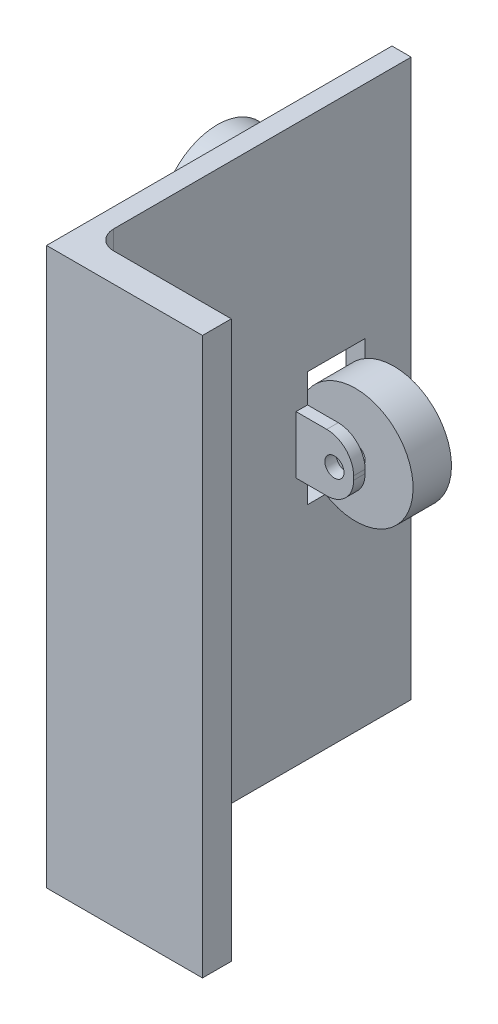
ISO-10303-21;
HEADER;
FILE_DESCRIPTION(('STEP AP214'),'2;1');
FILE_NAME('part.step','',(''),(''),'','','');
FILE_SCHEMA(('AUTOMOTIVE_DESIGN { 1 0 10303 214 1 1 1 1 }'));
ENDSEC;
DATA;
#1=APPLICATION_CONTEXT('core data for automotive mechanical design processes');
#2=APPLICATION_PROTOCOL_DEFINITION('international standard','automotive_design',2000,#1);
#3=PRODUCT_CONTEXT('',#1,'mechanical');
#4=PRODUCT('Part','Part','',(#3));
#5=PRODUCT_RELATED_PRODUCT_CATEGORY('part','',(#4));
#6=PRODUCT_DEFINITION_FORMATION('','',#4);
#7=PRODUCT_DEFINITION_CONTEXT('part definition',#1,'design');
#8=PRODUCT_DEFINITION('design','',#6,#7);
#9=PRODUCT_DEFINITION_SHAPE('','',#8);
#10=(LENGTH_UNIT() NAMED_UNIT(*) SI_UNIT(.MILLI.,.METRE.));
#11=(NAMED_UNIT(*) PLANE_ANGLE_UNIT() SI_UNIT($,.RADIAN.));
#12=(NAMED_UNIT(*) SI_UNIT($,.STERADIAN.) SOLID_ANGLE_UNIT());
#13=UNCERTAINTY_MEASURE_WITH_UNIT(LENGTH_MEASURE(1.E-05),#10,'distance_accuracy_value','');
#14=(GEOMETRIC_REPRESENTATION_CONTEXT(3) GLOBAL_UNCERTAINTY_ASSIGNED_CONTEXT((#13)) GLOBAL_UNIT_ASSIGNED_CONTEXT((#10,
#11,#12)) REPRESENTATION_CONTEXT('',''));
#15=CARTESIAN_POINT('',(0.,0.,0.));
#16=DIRECTION('',(0.,0.,1.));
#17=DIRECTION('',(1.,0.,0.));
#18=AXIS2_PLACEMENT_3D('',#15,#16,#17);
#19=CARTESIAN_POINT('',(15.,72.5,-75.5));
#20=DIRECTION('',(0.,0.,1.));
#21=DIRECTION('',(0.,-1.,0.));
#22=AXIS2_PLACEMENT_3D('',#19,#20,#21);
#23=CYLINDRICAL_SURFACE('',#22,15.);
#24=CARTESIAN_POINT('',(15.,72.5,-75.5));
#25=DIRECTION('',(0.,0.,-1.));
#26=DIRECTION('',(0.,1.,0.));
#27=AXIS2_PLACEMENT_3D('',#24,#25,#26);
#28=CIRCLE('',#27,15.);
#29=CARTESIAN_POINT('',(15.,87.5,-75.5));
#30=VERTEX_POINT('',#29);
#31=EDGE_CURVE('E11',#30,#30,#28,.T.);
#32=ORIENTED_EDGE('',*,*,#31,.F.);
#33=EDGE_LOOP('',(#32));
#34=FACE_BOUND('',#33,.T.);
#35=CARTESIAN_POINT('',(15.,72.5,-65.5));
#36=DIRECTION('',(0.,0.,-1.));
#37=DIRECTION('',(0.,1.,0.));
#38=AXIS2_PLACEMENT_3D('',#35,#36,#37);
#39=CIRCLE('',#38,15.);
#40=CARTESIAN_POINT('',(15.,87.5,-65.5));
#41=VERTEX_POINT('',#40);
#42=EDGE_CURVE('E48',#41,#41,#39,.T.);
#43=ORIENTED_EDGE('',*,*,#42,.T.);
#44=EDGE_LOOP('',(#43));
#45=FACE_BOUND('',#44,.T.);
#46=ADVANCED_FACE('F41',(#34,#45),#23,.T.);
#47=CARTESIAN_POINT('',(15.,72.5,-75.5));
#48=DIRECTION('',(0.,0.,-1.));
#49=DIRECTION('',(0.,1.,0.));
#50=AXIS2_PLACEMENT_3D('',#47,#48,#49);
#51=PLANE('',#50);
#52=CARTESIAN_POINT('',(15.,72.5,-75.5));
#53=DIRECTION('',(0.,0.,-1.));
#54=DIRECTION('',(0.,1.,0.));
#55=AXIS2_PLACEMENT_3D('',#52,#53,#54);
#56=CIRCLE('',#55,2.5);
#57=CARTESIAN_POINT('',(15.,75.,-75.5));
#58=VERTEX_POINT('',#57);
#59=EDGE_CURVE('E53',#58,#58,#56,.T.);
#60=ORIENTED_EDGE('',*,*,#59,.F.);
#61=EDGE_LOOP('',(#60));
#62=FACE_BOUND('',#61,.T.);
#63=ORIENTED_EDGE('',*,*,#31,.T.);
#64=EDGE_LOOP('',(#63));
#65=FACE_BOUND('',#64,.T.);
#66=ADVANCED_FACE('F70',(#62,#65),#51,.T.);
#67=CARTESIAN_POINT('',(15.,72.5,-65.5));
#68=DIRECTION('',(0.,0.,-1.));
#69=DIRECTION('',(0.,1.,0.));
#70=AXIS2_PLACEMENT_3D('',#67,#68,#69);
#71=PLANE('',#70);
#72=CARTESIAN_POINT('',(15.,72.5,-65.5));
#73=DIRECTION('',(0.,0.,-1.));
#74=DIRECTION('',(0.,1.,0.));
#75=AXIS2_PLACEMENT_3D('',#72,#73,#74);
#76=CIRCLE('',#75,2.5);
#77=CARTESIAN_POINT('',(15.,75.,-65.5));
#78=VERTEX_POINT('',#77);
#79=EDGE_CURVE('E44',#78,#78,#76,.T.);
#80=ORIENTED_EDGE('',*,*,#79,.T.);
#81=EDGE_LOOP('',(#80));
#82=FACE_BOUND('',#81,.T.);
#83=ORIENTED_EDGE('',*,*,#42,.F.);
#84=EDGE_LOOP('',(#83));
#85=FACE_BOUND('',#84,.T.);
#86=ADVANCED_FACE('F61',(#82,#85),#71,.F.);
#87=CARTESIAN_POINT('',(15.,72.5,-56.));
#88=DIRECTION('',(0.,0.,-1.));
#89=DIRECTION('',(-1.,0.,0.));
#90=AXIS2_PLACEMENT_3D('',#87,#88,#89);
#91=CYLINDRICAL_SURFACE('',#90,2.5);
#92=ORIENTED_EDGE('',*,*,#59,.T.);
#93=EDGE_LOOP('',(#92));
#94=FACE_BOUND('',#93,.T.);
#95=ORIENTED_EDGE('',*,*,#79,.F.);
#96=EDGE_LOOP('',(#95));
#97=FACE_BOUND('',#96,.T.);
#98=ADVANCED_FACE('F64',(#94,#97),#91,.F.);
#99=CLOSED_SHELL('',(#46,#66,#86,#98));
#100=MANIFOLD_SOLID_BREP('B2',#99);
#101=CARTESIAN_POINT('',(5.,145.,-90.));
#102=DIRECTION('',(-1.,0.,0.));
#103=DIRECTION('',(0.,0.,1.));
#104=AXIS2_PLACEMENT_3D('',#101,#102,#103);
#105=PLANE('',#104);
#106=DIRECTION('',(0.,0.,-1.));
#107=VECTOR('',#106,1.);
#108=CARTESIAN_POINT('',(5.,0.,-90.));
#109=LINE('',#108,#107);
#110=CARTESIAN_POINT('',(5.,0.,-12.5));
#111=VERTEX_POINT('',#110);
#112=CARTESIAN_POINT('',(5.,0.,-90.));
#113=VERTEX_POINT('',#112);
#114=EDGE_CURVE('E381',#111,#113,#109,.T.);
#115=ORIENTED_EDGE('',*,*,#114,.T.);
#116=DIRECTION('',(0.,-1.,0.));
#117=VECTOR('',#116,1.);
#118=CARTESIAN_POINT('',(5.,145.,-90.));
#119=LINE('',#118,#117);
#120=CARTESIAN_POINT('',(5.,145.,-90.));
#121=VERTEX_POINT('',#120);
#122=EDGE_CURVE('E391',#121,#113,#119,.T.);
#123=ORIENTED_EDGE('',*,*,#122,.F.);
#124=DIRECTION('',(0.,0.,-1.));
#125=VECTOR('',#124,1.);
#126=CARTESIAN_POINT('',(5.,145.,-90.));
#127=LINE('',#126,#125);
#128=CARTESIAN_POINT('',(5.,145.,-12.5));
#129=VERTEX_POINT('',#128);
#130=EDGE_CURVE('E366',#129,#121,#127,.T.);
#131=ORIENTED_EDGE('',*,*,#130,.F.);
#132=DIRECTION('',(0.,-1.,0.));
#133=VECTOR('',#132,1.);
#134=CARTESIAN_POINT('',(5.,145.,-12.5));
#135=LINE('',#134,#133);
#136=EDGE_CURVE('E394',#129,#111,#135,.T.);
#137=ORIENTED_EDGE('',*,*,#136,.T.);
#138=EDGE_LOOP('',(#115,#123,#131,#137));
#139=FACE_BOUND('',#138,.T.);
#140=DIRECTION('',(0.,0.,1.));
#141=VECTOR('',#140,1.);
#142=CARTESIAN_POINT('',(5.,80.,-78.));
#143=LINE('',#142,#141);
#144=CARTESIAN_POINT('',(5.,80.,-81.));
#145=VERTEX_POINT('',#144);
#146=CARTESIAN_POINT('',(5.,80.,-78.));
#147=VERTEX_POINT('',#146);
#148=EDGE_CURVE('E285',#145,#147,#143,.T.);
#149=ORIENTED_EDGE('',*,*,#148,.F.);
#150=DIRECTION('',(0.,1.,0.));
#151=VECTOR('',#150,1.);
#152=CARTESIAN_POINT('',(5.,80.,-81.));
#153=LINE('',#152,#151);
#154=CARTESIAN_POINT('',(5.,65.,-81.));
#155=VERTEX_POINT('',#154);
#156=EDGE_CURVE('E284',#155,#145,#153,.T.);
#157=ORIENTED_EDGE('',*,*,#156,.F.);
#158=DIRECTION('',(0.,0.,-1.));
#159=VECTOR('',#158,1.);
#160=CARTESIAN_POINT('',(5.,65.,-78.));
#161=LINE('',#160,#159);
#162=CARTESIAN_POINT('',(5.,65.,-78.));
#163=VERTEX_POINT('',#162);
#164=EDGE_CURVE('E262',#163,#155,#161,.T.);
#165=ORIENTED_EDGE('',*,*,#164,.F.);
#166=DIRECTION('',(0.,-1.,0.));
#167=VECTOR('',#166,1.);
#168=CARTESIAN_POINT('',(5.,145.,-78.0000000000001));
#169=LINE('',#168,#167);
#170=CARTESIAN_POINT('',(5.,57.5,-78.));
#171=VERTEX_POINT('',#170);
#172=EDGE_CURVE('E270',#163,#171,#169,.T.);
#173=ORIENTED_EDGE('',*,*,#172,.T.);
#174=DIRECTION('',(0.,0.,1.));
#175=VECTOR('',#174,1.);
#176=CARTESIAN_POINT('',(5.,57.5,-90.));
#177=LINE('',#176,#175);
#178=CARTESIAN_POINT('',(5.,57.5,-63.));
#179=VERTEX_POINT('',#178);
#180=EDGE_CURVE('E335',#171,#179,#177,.T.);
#181=ORIENTED_EDGE('',*,*,#180,.T.);
#182=DIRECTION('',(0.,1.,0.));
#183=VECTOR('',#182,1.);
#184=CARTESIAN_POINT('',(5.,145.,-63.));
#185=LINE('',#184,#183);
#186=CARTESIAN_POINT('',(5.,65.,-63.));
#187=VERTEX_POINT('',#186);
#188=EDGE_CURVE('E343',#179,#187,#185,.T.);
#189=ORIENTED_EDGE('',*,*,#188,.T.);
#190=DIRECTION('',(0.,0.,-1.));
#191=VECTOR('',#190,1.);
#192=CARTESIAN_POINT('',(5.,65.,-63.));
#193=LINE('',#192,#191);
#194=CARTESIAN_POINT('',(5.,65.,-60.));
#195=VERTEX_POINT('',#194);
#196=EDGE_CURVE('E304',#195,#187,#193,.T.);
#197=ORIENTED_EDGE('',*,*,#196,.F.);
#198=DIRECTION('',(0.,-1.,0.));
#199=VECTOR('',#198,1.);
#200=CARTESIAN_POINT('',(5.,80.,-60.));
#201=LINE('',#200,#199);
#202=CARTESIAN_POINT('',(5.,80.,-60.));
#203=VERTEX_POINT('',#202);
#204=EDGE_CURVE('E310',#203,#195,#201,.T.);
#205=ORIENTED_EDGE('',*,*,#204,.F.);
#206=DIRECTION('',(0.,0.,1.));
#207=VECTOR('',#206,1.);
#208=CARTESIAN_POINT('',(5.,80.,-63.));
#209=LINE('',#208,#207);
#210=CARTESIAN_POINT('',(5.,80.,-63.));
#211=VERTEX_POINT('',#210);
#212=EDGE_CURVE('E299',#211,#203,#209,.T.);
#213=ORIENTED_EDGE('',*,*,#212,.F.);
#214=CARTESIAN_POINT('',(5.,87.5,-63.));
#215=VERTEX_POINT('',#214);
#216=EDGE_CURVE('E342',#211,#215,#185,.T.);
#217=ORIENTED_EDGE('',*,*,#216,.T.);
#218=DIRECTION('',(0.,0.,-1.));
#219=VECTOR('',#218,1.);
#220=CARTESIAN_POINT('',(5.,87.5,-90.));
#221=LINE('',#220,#219);
#222=CARTESIAN_POINT('',(5.,87.5,-78.));
#223=VERTEX_POINT('',#222);
#224=EDGE_CURVE('E279',#215,#223,#221,.T.);
#225=ORIENTED_EDGE('',*,*,#224,.T.);
#226=EDGE_CURVE('E278',#223,#147,#169,.T.);
#227=ORIENTED_EDGE('',*,*,#226,.T.);
#228=EDGE_LOOP('',(#149,#157,#165,#173,#181,#189,#197,#205,#213,#217,#225,#227));
#229=FACE_BOUND('',#228,.T.);
#230=ADVANCED_FACE('F103',(#139,#229),#105,.F.);
#231=CARTESIAN_POINT('',(0.,145.,0.));
#232=DIRECTION('',(0.,0.,-1.));
#233=DIRECTION('',(-1.,0.,0.));
#234=AXIS2_PLACEMENT_3D('',#231,#232,#233);
#235=PLANE('',#234);
#236=DIRECTION('',(1.,0.,0.));
#237=VECTOR('',#236,1.);
#238=CARTESIAN_POINT('',(0.,0.,0.));
#239=LINE('',#238,#237);
#240=CARTESIAN_POINT('',(0.,0.,0.));
#241=VERTEX_POINT('',#240);
#242=CARTESIAN_POINT('',(40.625,0.,0.));
#243=VERTEX_POINT('',#242);
#244=EDGE_CURVE('E355',#241,#243,#239,.T.);
#245=ORIENTED_EDGE('',*,*,#244,.T.);
#246=DIRECTION('',(0.,-1.,0.));
#247=VECTOR('',#246,1.);
#248=CARTESIAN_POINT('',(40.625,145.,0.));
#249=LINE('',#248,#247);
#250=CARTESIAN_POINT('',(40.625,145.,0.));
#251=VERTEX_POINT('',#250);
#252=EDGE_CURVE('E403',#251,#243,#249,.T.);
#253=ORIENTED_EDGE('',*,*,#252,.F.);
#254=DIRECTION('',(1.,0.,0.));
#255=VECTOR('',#254,1.);
#256=CARTESIAN_POINT('',(0.,145.,0.));
#257=LINE('',#256,#255);
#258=CARTESIAN_POINT('',(0.,145.,0.));
#259=VERTEX_POINT('',#258);
#260=EDGE_CURVE('E356',#259,#251,#257,.T.);
#261=ORIENTED_EDGE('',*,*,#260,.F.);
#262=DIRECTION('',(0.,-1.,0.));
#263=VECTOR('',#262,1.);
#264=CARTESIAN_POINT('',(0.,145.,0.));
#265=LINE('',#264,#263);
#266=EDGE_CURVE('E372',#259,#241,#265,.T.);
#267=ORIENTED_EDGE('',*,*,#266,.T.);
#268=EDGE_LOOP('',(#245,#253,#261,#267));
#269=FACE_BOUND('',#268,.T.);
#270=ADVANCED_FACE('F480',(#269),#235,.F.);
#271=CARTESIAN_POINT('',(40.625,145.,0.));
#272=DIRECTION('',(-1.,0.,0.));
#273=DIRECTION('',(0.,0.,1.));
#274=AXIS2_PLACEMENT_3D('',#271,#272,#273);
#275=PLANE('',#274);
#276=DIRECTION('',(0.,0.,-1.));
#277=VECTOR('',#276,1.);
#278=CARTESIAN_POINT('',(40.625,0.,0.));
#279=LINE('',#278,#277);
#280=CARTESIAN_POINT('',(40.625,0.,-7.5));
#281=VERTEX_POINT('',#280);
#282=EDGE_CURVE('E375',#243,#281,#279,.T.);
#283=ORIENTED_EDGE('',*,*,#282,.T.);
#284=DIRECTION('',(0.,-1.,0.));
#285=VECTOR('',#284,1.);
#286=CARTESIAN_POINT('',(40.625,145.,-7.5));
#287=LINE('',#286,#285);
#288=CARTESIAN_POINT('',(40.625,145.,-7.5));
#289=VERTEX_POINT('',#288);
#290=EDGE_CURVE('E400',#289,#281,#287,.T.);
#291=ORIENTED_EDGE('',*,*,#290,.F.);
#292=DIRECTION('',(0.,0.,-1.));
#293=VECTOR('',#292,1.);
#294=CARTESIAN_POINT('',(40.625,145.,0.));
#295=LINE('',#294,#293);
#296=EDGE_CURVE('E359',#251,#289,#295,.T.);
#297=ORIENTED_EDGE('',*,*,#296,.F.);
#298=ORIENTED_EDGE('',*,*,#252,.T.);
#299=EDGE_LOOP('',(#283,#291,#297,#298));
#300=FACE_BOUND('',#299,.T.);
#301=ADVANCED_FACE('F488',(#300),#275,.F.);
#302=CARTESIAN_POINT('',(10.,145.,-7.5));
#303=DIRECTION('',(0.,0.,1.));
#304=DIRECTION('',(1.,0.,0.));
#305=AXIS2_PLACEMENT_3D('',#302,#303,#304);
#306=PLANE('',#305);
#307=DIRECTION('',(-1.,0.,0.));
#308=VECTOR('',#307,1.);
#309=CARTESIAN_POINT('',(10.,0.,-7.5));
#310=LINE('',#309,#308);
#311=CARTESIAN_POINT('',(10.,0.,-7.5));
#312=VERTEX_POINT('',#311);
#313=EDGE_CURVE('E377',#281,#312,#310,.T.);
#314=ORIENTED_EDGE('',*,*,#313,.T.);
#315=DIRECTION('',(0.,-1.,0.));
#316=VECTOR('',#315,1.);
#317=CARTESIAN_POINT('',(10.,145.,-7.5));
#318=LINE('',#317,#316);
#319=CARTESIAN_POINT('',(10.,145.,-7.5));
#320=VERTEX_POINT('',#319);
#321=EDGE_CURVE('E397',#320,#312,#318,.T.);
#322=ORIENTED_EDGE('',*,*,#321,.F.);
#323=DIRECTION('',(-1.,0.,0.));
#324=VECTOR('',#323,1.);
#325=CARTESIAN_POINT('',(10.,145.,-7.5));
#326=LINE('',#325,#324);
#327=EDGE_CURVE('E362',#289,#320,#326,.T.);
#328=ORIENTED_EDGE('',*,*,#327,.F.);
#329=ORIENTED_EDGE('',*,*,#290,.T.);
#330=EDGE_LOOP('',(#314,#322,#328,#329));
#331=FACE_BOUND('',#330,.T.);
#332=ADVANCED_FACE('F498',(#331),#306,.F.);
#333=CARTESIAN_POINT('',(10.,145.,-12.5));
#334=DIRECTION('',(0.,-1.,0.));
#335=DIRECTION('',(0.,0.,-1.));
#336=AXIS2_PLACEMENT_3D('',#333,#334,#335);
#337=CYLINDRICAL_SURFACE('',#336,5.);
#338=CARTESIAN_POINT('',(10.,0.,-12.5));
#339=DIRECTION('',(0.,-1.,0.));
#340=DIRECTION('',(0.,0.,1.));
#341=AXIS2_PLACEMENT_3D('',#338,#339,#340);
#342=CIRCLE('',#341,5.);
#343=EDGE_CURVE('E379',#312,#111,#342,.T.);
#344=ORIENTED_EDGE('',*,*,#343,.T.);
#345=ORIENTED_EDGE('',*,*,#136,.F.);
#346=CARTESIAN_POINT('',(10.,145.,-12.5));
#347=DIRECTION('',(0.,-1.,0.));
#348=DIRECTION('',(0.,0.,1.));
#349=AXIS2_PLACEMENT_3D('',#346,#347,#348);
#350=CIRCLE('',#349,5.);
#351=EDGE_CURVE('E364',#320,#129,#350,.T.);
#352=ORIENTED_EDGE('',*,*,#351,.F.);
#353=ORIENTED_EDGE('',*,*,#321,.T.);
#354=EDGE_LOOP('',(#344,#345,#352,#353));
#355=FACE_BOUND('',#354,.T.);
#356=ADVANCED_FACE('F495',(#355),#337,.F.);
#357=CARTESIAN_POINT('',(0.,145.,-90.));
#358=DIRECTION('',(0.,0.,1.));
#359=DIRECTION('',(1.,0.,0.));
#360=AXIS2_PLACEMENT_3D('',#357,#358,#359);
#361=PLANE('',#360);
#362=DIRECTION('',(-1.,0.,0.));
#363=VECTOR('',#362,1.);
#364=CARTESIAN_POINT('',(0.,0.,-90.));
#365=LINE('',#364,#363);
#366=CARTESIAN_POINT('',(0.,0.,-90.));
#367=VERTEX_POINT('',#366);
#368=EDGE_CURVE('E383',#113,#367,#365,.T.);
#369=ORIENTED_EDGE('',*,*,#368,.T.);
#370=DIRECTION('',(0.,-1.,0.));
#371=VECTOR('',#370,1.);
#372=CARTESIAN_POINT('',(0.,145.,-90.));
#373=LINE('',#372,#371);
#374=CARTESIAN_POINT('',(0.,145.,-90.));
#375=VERTEX_POINT('',#374);
#376=EDGE_CURVE('E388',#375,#367,#373,.T.);
#377=ORIENTED_EDGE('',*,*,#376,.F.);
#378=DIRECTION('',(-1.,0.,0.));
#379=VECTOR('',#378,1.);
#380=CARTESIAN_POINT('',(0.,145.,-90.));
#381=LINE('',#380,#379);
#382=EDGE_CURVE('E368',#121,#375,#381,.T.);
#383=ORIENTED_EDGE('',*,*,#382,.F.);
#384=ORIENTED_EDGE('',*,*,#122,.T.);
#385=EDGE_LOOP('',(#369,#377,#383,#384));
#386=FACE_BOUND('',#385,.T.);
#387=ADVANCED_FACE('F493',(#386),#361,.F.);
#388=CARTESIAN_POINT('',(0.,145.,0.));
#389=DIRECTION('',(1.,0.,0.));
#390=DIRECTION('',(0.,0.,-1.));
#391=AXIS2_PLACEMENT_3D('',#388,#389,#390);
#392=PLANE('',#391);
#393=DIRECTION('',(0.,0.,1.));
#394=VECTOR('',#393,1.);
#395=CARTESIAN_POINT('',(0.,57.5,-78.));
#396=LINE('',#395,#394);
#397=CARTESIAN_POINT('',(0.,57.5,-78.));
#398=VERTEX_POINT('',#397);
#399=CARTESIAN_POINT('',(0.,57.5,-63.));
#400=VERTEX_POINT('',#399);
#401=EDGE_CURVE('E324',#398,#400,#396,.T.);
#402=ORIENTED_EDGE('',*,*,#401,.F.);
#403=DIRECTION('',(0.,-1.,0.));
#404=VECTOR('',#403,1.);
#405=CARTESIAN_POINT('',(0.,87.5,-78.));
#406=LINE('',#405,#404);
#407=CARTESIAN_POINT('',(0.,87.5,-78.));
#408=VERTEX_POINT('',#407);
#409=EDGE_CURVE('E322',#408,#398,#406,.T.);
#410=ORIENTED_EDGE('',*,*,#409,.F.);
#411=DIRECTION('',(0.,0.,-1.));
#412=VECTOR('',#411,1.);
#413=CARTESIAN_POINT('',(0.,87.5,-78.));
#414=LINE('',#413,#412);
#415=CARTESIAN_POINT('',(0.,87.5,-63.));
#416=VERTEX_POINT('',#415);
#417=EDGE_CURVE('E330',#416,#408,#414,.T.);
#418=ORIENTED_EDGE('',*,*,#417,.F.);
#419=DIRECTION('',(0.,1.,0.));
#420=VECTOR('',#419,1.);
#421=CARTESIAN_POINT('',(0.,87.5,-63.));
#422=LINE('',#421,#420);
#423=EDGE_CURVE('E327',#400,#416,#422,.T.);
#424=ORIENTED_EDGE('',*,*,#423,.F.);
#425=EDGE_LOOP('',(#402,#410,#418,#424));
#426=FACE_BOUND('',#425,.T.);
#427=CARTESIAN_POINT('',(0.,20.,-54.5));
#428=DIRECTION('',(1.,0.,0.));
#429=DIRECTION('',(0.,0.,-1.));
#430=AXIS2_PLACEMENT_3D('',#427,#428,#429);
#431=CIRCLE('',#430,15.);
#432=CARTESIAN_POINT('',(0.,20.,-69.5));
#433=VERTEX_POINT('',#432);
#434=EDGE_CURVE('E409',#433,#433,#431,.F.);
#435=ORIENTED_EDGE('',*,*,#434,.F.);
#436=EDGE_LOOP('',(#435));
#437=FACE_BOUND('',#436,.T.);
#438=CARTESIAN_POINT('',(0.,125.,-54.5));
#439=DIRECTION('',(1.,0.,0.));
#440=DIRECTION('',(0.,0.,-1.));
#441=AXIS2_PLACEMENT_3D('',#438,#439,#440);
#442=CIRCLE('',#441,15.);
#443=CARTESIAN_POINT('',(0.,125.,-69.5));
#444=VERTEX_POINT('',#443);
#445=EDGE_CURVE('E406',#444,#444,#442,.F.);
#446=ORIENTED_EDGE('',*,*,#445,.F.);
#447=EDGE_LOOP('',(#446));
#448=FACE_BOUND('',#447,.T.);
#449=DIRECTION('',(0.,0.,1.));
#450=VECTOR('',#449,1.);
#451=CARTESIAN_POINT('',(0.,0.,0.));
#452=LINE('',#451,#450);
#453=EDGE_CURVE('E360',#367,#241,#452,.T.);
#454=ORIENTED_EDGE('',*,*,#453,.T.);
#455=ORIENTED_EDGE('',*,*,#266,.F.);
#456=DIRECTION('',(0.,0.,1.));
#457=VECTOR('',#456,1.);
#458=CARTESIAN_POINT('',(0.,145.,0.));
#459=LINE('',#458,#457);
#460=EDGE_CURVE('E370',#375,#259,#459,.T.);
#461=ORIENTED_EDGE('',*,*,#460,.F.);
#462=ORIENTED_EDGE('',*,*,#376,.T.);
#463=EDGE_LOOP('',(#454,#455,#461,#462));
#464=FACE_BOUND('',#463,.T.);
#465=ADVANCED_FACE('F571',(#426,#437,#448,#464),#392,.F.);
#466=CARTESIAN_POINT('',(10.,145.,-12.5));
#467=DIRECTION('',(0.,1.,0.));
#468=DIRECTION('',(0.,0.,1.));
#469=AXIS2_PLACEMENT_3D('',#466,#467,#468);
#470=PLANE('',#469);
#471=ORIENTED_EDGE('',*,*,#260,.T.);
#472=ORIENTED_EDGE('',*,*,#296,.T.);
#473=ORIENTED_EDGE('',*,*,#327,.T.);
#474=ORIENTED_EDGE('',*,*,#351,.T.);
#475=ORIENTED_EDGE('',*,*,#130,.T.);
#476=ORIENTED_EDGE('',*,*,#382,.T.);
#477=ORIENTED_EDGE('',*,*,#460,.T.);
#478=EDGE_LOOP('',(#471,#472,#473,#474,#475,#476,#477));
#479=FACE_BOUND('',#478,.T.);
#480=ADVANCED_FACE('F601',(#479),#470,.T.);
#481=CARTESIAN_POINT('',(10.,0.,-12.5));
#482=DIRECTION('',(0.,1.,0.));
#483=DIRECTION('',(0.,0.,1.));
#484=AXIS2_PLACEMENT_3D('',#481,#482,#483);
#485=PLANE('',#484);
#486=ORIENTED_EDGE('',*,*,#244,.F.);
#487=ORIENTED_EDGE('',*,*,#453,.F.);
#488=ORIENTED_EDGE('',*,*,#368,.F.);
#489=ORIENTED_EDGE('',*,*,#114,.F.);
#490=ORIENTED_EDGE('',*,*,#343,.F.);
#491=ORIENTED_EDGE('',*,*,#313,.F.);
#492=ORIENTED_EDGE('',*,*,#282,.F.);
#493=EDGE_LOOP('',(#486,#487,#488,#489,#490,#491,#492));
#494=FACE_BOUND('',#493,.T.);
#495=ADVANCED_FACE('F599',(#494),#485,.F.);
#496=CARTESIAN_POINT('',(-10.,125.,-54.5));
#497=DIRECTION('',(1.,0.,0.));
#498=DIRECTION('',(0.,0.,-1.));
#499=AXIS2_PLACEMENT_3D('',#496,#497,#498);
#500=CYLINDRICAL_SURFACE('',#499,15.);
#501=CARTESIAN_POINT('',(-10.,125.,-54.5));
#502=DIRECTION('',(-1.,0.,0.));
#503=DIRECTION('',(0.,0.,1.));
#504=AXIS2_PLACEMENT_3D('',#501,#502,#503);
#505=CIRCLE('',#504,15.);
#506=CARTESIAN_POINT('',(-10.,125.,-39.5));
#507=VERTEX_POINT('',#506);
#508=EDGE_CURVE('E352',#507,#507,#505,.T.);
#509=ORIENTED_EDGE('',*,*,#508,.F.);
#510=EDGE_LOOP('',(#509));
#511=FACE_BOUND('',#510,.T.);
#512=ORIENTED_EDGE('',*,*,#445,.T.);
#513=EDGE_LOOP('',(#512));
#514=FACE_BOUND('',#513,.T.);
#515=ADVANCED_FACE('F595',(#511,#514),#500,.T.);
#516=CARTESIAN_POINT('',(-10.,125.,-54.5));
#517=DIRECTION('',(-1.,0.,0.));
#518=DIRECTION('',(0.,0.,1.));
#519=AXIS2_PLACEMENT_3D('',#516,#517,#518);
#520=PLANE('',#519);
#521=ORIENTED_EDGE('',*,*,#508,.T.);
#522=EDGE_LOOP('',(#521));
#523=FACE_BOUND('',#522,.T.);
#524=ADVANCED_FACE('F591',(#523),#520,.T.);
#525=CARTESIAN_POINT('',(-10.,20.,-54.5));
#526=DIRECTION('',(1.,0.,0.));
#527=DIRECTION('',(0.,0.,-1.));
#528=AXIS2_PLACEMENT_3D('',#525,#526,#527);
#529=CYLINDRICAL_SURFACE('',#528,15.);
#530=CARTESIAN_POINT('',(-10.,20.,-54.5));
#531=DIRECTION('',(-1.,0.,0.));
#532=DIRECTION('',(0.,0.,-1.));
#533=AXIS2_PLACEMENT_3D('',#530,#531,#532);
#534=CIRCLE('',#533,15.);
#535=CARTESIAN_POINT('',(-10.,20.,-69.5));
#536=VERTEX_POINT('',#535);
#537=EDGE_CURVE('E349',#536,#536,#534,.T.);
#538=ORIENTED_EDGE('',*,*,#537,.F.);
#539=EDGE_LOOP('',(#538));
#540=FACE_BOUND('',#539,.T.);
#541=ORIENTED_EDGE('',*,*,#434,.T.);
#542=EDGE_LOOP('',(#541));
#543=FACE_BOUND('',#542,.T.);
#544=ADVANCED_FACE('F587',(#540,#543),#529,.T.);
#545=CARTESIAN_POINT('',(-10.,20.,-54.5));
#546=DIRECTION('',(1.,0.,0.));
#547=DIRECTION('',(0.,0.,-1.));
#548=AXIS2_PLACEMENT_3D('',#545,#546,#547);
#549=PLANE('',#548);
#550=ORIENTED_EDGE('',*,*,#537,.T.);
#551=EDGE_LOOP('',(#550));
#552=FACE_BOUND('',#551,.T.);
#553=ADVANCED_FACE('F583',(#552),#549,.F.);
#554=CARTESIAN_POINT('',(10.,87.5,-78.));
#555=DIRECTION('',(0.,0.,-1.));
#556=DIRECTION('',(0.,1.,0.));
#557=AXIS2_PLACEMENT_3D('',#554,#555,#556);
#558=PLANE('',#557);
#559=CARTESIAN_POINT('',(15.,72.5,-78.));
#560=DIRECTION('',(0.,0.,-1.));
#561=DIRECTION('',(0.,1.,0.));
#562=AXIS2_PLACEMENT_3D('',#559,#560,#561);
#563=CIRCLE('',#562,2.5);
#564=CARTESIAN_POINT('',(15.,75.,-78.));
#565=VERTEX_POINT('',#564);
#566=EDGE_CURVE('E290',#565,#565,#563,.T.);
#567=ORIENTED_EDGE('',*,*,#566,.T.);
#568=EDGE_LOOP('',(#567));
#569=FACE_BOUND('',#568,.T.);
#570=DIRECTION('',(0.,-1.,0.));
#571=VECTOR('',#570,1.);
#572=CARTESIAN_POINT('',(20.,80.,-78.));
#573=LINE('',#572,#571);
#574=CARTESIAN_POINT('',(20.,73.,-78.));
#575=VERTEX_POINT('',#574);
#576=CARTESIAN_POINT('',(20.,72.,-78.));
#577=VERTEX_POINT('',#576);
#578=EDGE_CURVE('E287',#575,#577,#573,.T.);
#579=ORIENTED_EDGE('',*,*,#578,.F.);
#580=CARTESIAN_POINT('',(13.,73.,-78.));
#581=DIRECTION('',(0.,0.,-1.));
#582=DIRECTION('',(0.,1.,0.));
#583=AXIS2_PLACEMENT_3D('',#580,#581,#582);
#584=CIRCLE('',#583,7.);
#585=CARTESIAN_POINT('',(13.,80.,-78.));
#586=VERTEX_POINT('',#585);
#587=EDGE_CURVE('E438',#575,#586,#584,.F.);
#588=ORIENTED_EDGE('',*,*,#587,.T.);
#589=DIRECTION('',(-1.,0.,0.));
#590=VECTOR('',#589,1.);
#591=CARTESIAN_POINT('',(20.,80.,-78.));
#592=LINE('',#591,#590);
#593=EDGE_CURVE('E266',#586,#147,#592,.T.);
#594=ORIENTED_EDGE('',*,*,#593,.T.);
#595=ORIENTED_EDGE('',*,*,#226,.F.);
#596=DIRECTION('',(-1.,0.,0.));
#597=VECTOR('',#596,1.);
#598=CARTESIAN_POINT('',(10.,87.5,-78.));
#599=LINE('',#598,#597);
#600=EDGE_CURVE('E333',#223,#408,#599,.T.);
#601=ORIENTED_EDGE('',*,*,#600,.T.);
#602=ORIENTED_EDGE('',*,*,#409,.T.);
#603=DIRECTION('',(-1.,0.,0.));
#604=VECTOR('',#603,1.);
#605=CARTESIAN_POINT('',(10.,57.5,-78.));
#606=LINE('',#605,#604);
#607=EDGE_CURVE('E274',#171,#398,#606,.T.);
#608=ORIENTED_EDGE('',*,*,#607,.F.);
#609=ORIENTED_EDGE('',*,*,#172,.F.);
#610=DIRECTION('',(-1.,0.,0.));
#611=VECTOR('',#610,1.);
#612=CARTESIAN_POINT('',(20.,65.,-78.));
#613=LINE('',#612,#611);
#614=CARTESIAN_POINT('',(13.,65.,-78.));
#615=VERTEX_POINT('',#614);
#616=EDGE_CURVE('E258',#615,#163,#613,.T.);
#617=ORIENTED_EDGE('',*,*,#616,.F.);
#618=CARTESIAN_POINT('',(13.,72.,-78.));
#619=DIRECTION('',(0.,0.,-1.));
#620=DIRECTION('',(0.,1.,0.));
#621=AXIS2_PLACEMENT_3D('',#618,#619,#620);
#622=CIRCLE('',#621,7.);
#623=EDGE_CURVE('E436',#615,#577,#622,.F.);
#624=ORIENTED_EDGE('',*,*,#623,.T.);
#625=EDGE_LOOP('',(#579,#588,#594,#595,#601,#602,#608,#609,#617,#624));
#626=FACE_BOUND('',#625,.T.);
#627=ADVANCED_FACE('F272',(#569,#626),#558,.F.);
#628=CARTESIAN_POINT('',(10.,87.5,-78.));
#629=DIRECTION('',(0.,1.,0.));
#630=DIRECTION('',(0.,0.,1.));
#631=AXIS2_PLACEMENT_3D('',#628,#629,#630);
#632=PLANE('',#631);
#633=DIRECTION('',(-1.,0.,0.));
#634=VECTOR('',#633,1.);
#635=CARTESIAN_POINT('',(10.,87.5,-63.));
#636=LINE('',#635,#634);
#637=EDGE_CURVE('E336',#215,#416,#636,.T.);
#638=ORIENTED_EDGE('',*,*,#637,.T.);
#639=ORIENTED_EDGE('',*,*,#417,.T.);
#640=ORIENTED_EDGE('',*,*,#600,.F.);
#641=ORIENTED_EDGE('',*,*,#224,.F.);
#642=EDGE_LOOP('',(#638,#639,#640,#641));
#643=FACE_BOUND('',#642,.T.);
#644=ADVANCED_FACE('F535',(#643),#632,.F.);
#645=CARTESIAN_POINT('',(10.,87.5,-63.));
#646=DIRECTION('',(0.,0.,1.));
#647=DIRECTION('',(0.,-1.,0.));
#648=AXIS2_PLACEMENT_3D('',#645,#646,#647);
#649=PLANE('',#648);
#650=CARTESIAN_POINT('',(15.,72.5,-63.));
#651=DIRECTION('',(0.,0.,1.));
#652=DIRECTION('',(0.,-1.,0.));
#653=AXIS2_PLACEMENT_3D('',#650,#651,#652);
#654=CIRCLE('',#653,2.5);
#655=CARTESIAN_POINT('',(15.,70.,-63.));
#656=VERTEX_POINT('',#655);
#657=EDGE_CURVE('E457',#656,#656,#654,.T.);
#658=ORIENTED_EDGE('',*,*,#657,.T.);
#659=EDGE_LOOP('',(#658));
#660=FACE_BOUND('',#659,.T.);
#661=DIRECTION('',(-1.,0.,0.));
#662=VECTOR('',#661,1.);
#663=CARTESIAN_POINT('',(20.,80.,-63.));
#664=LINE('',#663,#662);
#665=CARTESIAN_POINT('',(13.,80.,-63.));
#666=VERTEX_POINT('',#665);
#667=EDGE_CURVE('E320',#666,#211,#664,.T.);
#668=ORIENTED_EDGE('',*,*,#667,.F.);
#669=CARTESIAN_POINT('',(13.,73.,-63.));
#670=DIRECTION('',(0.,0.,1.));
#671=DIRECTION('',(0.,-1.,0.));
#672=AXIS2_PLACEMENT_3D('',#669,#670,#671);
#673=CIRCLE('',#672,7.);
#674=CARTESIAN_POINT('',(20.,73.,-63.));
#675=VERTEX_POINT('',#674);
#676=EDGE_CURVE('E426',#666,#675,#673,.F.);
#677=ORIENTED_EDGE('',*,*,#676,.T.);
#678=DIRECTION('',(0.,1.,0.));
#679=VECTOR('',#678,1.);
#680=CARTESIAN_POINT('',(20.,80.,-63.));
#681=LINE('',#680,#679);
#682=CARTESIAN_POINT('',(20.,72.,-63.));
#683=VERTEX_POINT('',#682);
#684=EDGE_CURVE('E300',#683,#675,#681,.T.);
#685=ORIENTED_EDGE('',*,*,#684,.F.);
#686=CARTESIAN_POINT('',(13.,72.,-63.));
#687=DIRECTION('',(0.,0.,1.));
#688=DIRECTION('',(0.,-1.,0.));
#689=AXIS2_PLACEMENT_3D('',#686,#687,#688);
#690=CIRCLE('',#689,7.);
#691=CARTESIAN_POINT('',(13.,65.,-63.));
#692=VERTEX_POINT('',#691);
#693=EDGE_CURVE('E424',#683,#692,#690,.F.);
#694=ORIENTED_EDGE('',*,*,#693,.T.);
#695=DIRECTION('',(-1.,0.,0.));
#696=VECTOR('',#695,1.);
#697=CARTESIAN_POINT('',(20.,65.,-63.));
#698=LINE('',#697,#696);
#699=EDGE_CURVE('E307',#692,#187,#698,.T.);
#700=ORIENTED_EDGE('',*,*,#699,.T.);
#701=ORIENTED_EDGE('',*,*,#188,.F.);
#702=DIRECTION('',(-1.,0.,0.));
#703=VECTOR('',#702,1.);
#704=CARTESIAN_POINT('',(10.,57.5,-63.));
#705=LINE('',#704,#703);
#706=EDGE_CURVE('E338',#179,#400,#705,.T.);
#707=ORIENTED_EDGE('',*,*,#706,.T.);
#708=ORIENTED_EDGE('',*,*,#423,.T.);
#709=ORIENTED_EDGE('',*,*,#637,.F.);
#710=ORIENTED_EDGE('',*,*,#216,.F.);
#711=EDGE_LOOP('',(#668,#677,#685,#694,#700,#701,#707,#708,#709,#710));
#712=FACE_BOUND('',#711,.T.);
#713=ADVANCED_FACE('F531',(#660,#712),#649,.F.);
#714=CARTESIAN_POINT('',(10.,57.5,-78.));
#715=DIRECTION('',(0.,-1.,0.));
#716=DIRECTION('',(0.,0.,-1.));
#717=AXIS2_PLACEMENT_3D('',#714,#715,#716);
#718=PLANE('',#717);
#719=ORIENTED_EDGE('',*,*,#607,.T.);
#720=ORIENTED_EDGE('',*,*,#401,.T.);
#721=ORIENTED_EDGE('',*,*,#706,.F.);
#722=ORIENTED_EDGE('',*,*,#180,.F.);
#723=EDGE_LOOP('',(#719,#720,#721,#722));
#724=FACE_BOUND('',#723,.T.);
#725=ADVANCED_FACE('F534',(#724),#718,.F.);
#726=CARTESIAN_POINT('',(20.,80.,-63.));
#727=DIRECTION('',(0.,-1.,0.));
#728=DIRECTION('',(0.,0.,-1.));
#729=AXIS2_PLACEMENT_3D('',#726,#727,#728);
#730=PLANE('',#729);
#731=DIRECTION('',(-1.,0.,0.));
#732=VECTOR('',#731,1.);
#733=CARTESIAN_POINT('',(20.,80.,-60.));
#734=LINE('',#733,#732);
#735=CARTESIAN_POINT('',(13.,80.,-60.));
#736=VERTEX_POINT('',#735);
#737=EDGE_CURVE('E318',#736,#203,#734,.T.);
#738=ORIENTED_EDGE('',*,*,#737,.F.);
#739=DIRECTION('',(0.,0.,1.));
#740=VECTOR('',#739,1.);
#741=CARTESIAN_POINT('',(13.,80.,-63.));
#742=LINE('',#741,#740);
#743=EDGE_CURVE('E422',#736,#666,#742,.F.);
#744=ORIENTED_EDGE('',*,*,#743,.T.);
#745=ORIENTED_EDGE('',*,*,#667,.T.);
#746=ORIENTED_EDGE('',*,*,#212,.T.);
#747=EDGE_LOOP('',(#738,#744,#745,#746));
#748=FACE_BOUND('',#747,.T.);
#749=ADVANCED_FACE('F562',(#748),#730,.F.);
#750=CARTESIAN_POINT('',(20.,80.,-60.));
#751=DIRECTION('',(0.,0.,-1.));
#752=DIRECTION('',(-1.,0.,0.));
#753=AXIS2_PLACEMENT_3D('',#750,#751,#752);
#754=PLANE('',#753);
#755=CARTESIAN_POINT('',(15.,72.5,-60.));
#756=DIRECTION('',(0.,0.,-1.));
#757=DIRECTION('',(-1.,0.,0.));
#758=AXIS2_PLACEMENT_3D('',#755,#756,#757);
#759=CIRCLE('',#758,2.5);
#760=CARTESIAN_POINT('',(12.5,72.5,-60.));
#761=VERTEX_POINT('',#760);
#762=EDGE_CURVE('E460',#761,#761,#759,.T.);
#763=ORIENTED_EDGE('',*,*,#762,.T.);
#764=EDGE_LOOP('',(#763));
#765=FACE_BOUND('',#764,.T.);
#766=DIRECTION('',(0.,-1.,0.));
#767=VECTOR('',#766,1.);
#768=CARTESIAN_POINT('',(20.,80.,-60.));
#769=LINE('',#768,#767);
#770=CARTESIAN_POINT('',(20.,73.,-60.));
#771=VERTEX_POINT('',#770);
#772=CARTESIAN_POINT('',(20.,72.,-60.));
#773=VERTEX_POINT('',#772);
#774=EDGE_CURVE('E303',#771,#773,#769,.T.);
#775=ORIENTED_EDGE('',*,*,#774,.F.);
#776=CARTESIAN_POINT('',(13.,73.,-60.));
#777=DIRECTION('',(0.,0.,-1.));
#778=DIRECTION('',(-1.,0.,0.));
#779=AXIS2_PLACEMENT_3D('',#776,#777,#778);
#780=CIRCLE('',#779,7.);
#781=EDGE_CURVE('E420',#771,#736,#780,.F.);
#782=ORIENTED_EDGE('',*,*,#781,.T.);
#783=ORIENTED_EDGE('',*,*,#737,.T.);
#784=ORIENTED_EDGE('',*,*,#204,.T.);
#785=DIRECTION('',(-1.,0.,0.));
#786=VECTOR('',#785,1.);
#787=CARTESIAN_POINT('',(20.,65.,-60.));
#788=LINE('',#787,#786);
#789=CARTESIAN_POINT('',(13.,65.,-60.));
#790=VERTEX_POINT('',#789);
#791=EDGE_CURVE('E316',#790,#195,#788,.T.);
#792=ORIENTED_EDGE('',*,*,#791,.F.);
#793=CARTESIAN_POINT('',(13.,72.,-60.));
#794=DIRECTION('',(0.,0.,-1.));
#795=DIRECTION('',(-1.,0.,0.));
#796=AXIS2_PLACEMENT_3D('',#793,#794,#795);
#797=CIRCLE('',#796,7.);
#798=EDGE_CURVE('E418',#790,#773,#797,.F.);
#799=ORIENTED_EDGE('',*,*,#798,.T.);
#800=EDGE_LOOP('',(#775,#782,#783,#784,#792,#799));
#801=FACE_BOUND('',#800,.T.);
#802=ADVANCED_FACE('F551',(#765,#801),#754,.F.);
#803=CARTESIAN_POINT('',(20.,65.,-63.));
#804=DIRECTION('',(0.,1.,0.));
#805=DIRECTION('',(0.,0.,1.));
#806=AXIS2_PLACEMENT_3D('',#803,#804,#805);
#807=PLANE('',#806);
#808=ORIENTED_EDGE('',*,*,#699,.F.);
#809=DIRECTION('',(0.,0.,-1.));
#810=VECTOR('',#809,1.);
#811=CARTESIAN_POINT('',(13.,65.,-63.));
#812=LINE('',#811,#810);
#813=EDGE_CURVE('E428',#692,#790,#812,.F.);
#814=ORIENTED_EDGE('',*,*,#813,.T.);
#815=ORIENTED_EDGE('',*,*,#791,.T.);
#816=ORIENTED_EDGE('',*,*,#196,.T.);
#817=EDGE_LOOP('',(#808,#814,#815,#816));
#818=FACE_BOUND('',#817,.T.);
#819=ADVANCED_FACE('F559',(#818),#807,.F.);
#820=CARTESIAN_POINT('',(20.,0.,0.));
#821=DIRECTION('',(-1.,0.,0.));
#822=DIRECTION('',(0.,0.,1.));
#823=AXIS2_PLACEMENT_3D('',#820,#821,#822);
#824=PLANE('',#823);
#825=ORIENTED_EDGE('',*,*,#684,.T.);
#826=DIRECTION('',(0.,0.,1.));
#827=VECTOR('',#826,1.);
#828=CARTESIAN_POINT('',(20.,72.9999999999997,3.37021330795148E-13));
#829=LINE('',#828,#827);
#830=EDGE_CURVE('E415',#675,#771,#829,.T.);
#831=ORIENTED_EDGE('',*,*,#830,.T.);
#832=ORIENTED_EDGE('',*,*,#774,.T.);
#833=DIRECTION('',(0.,0.,-1.));
#834=VECTOR('',#833,1.);
#835=CARTESIAN_POINT('',(20.,72.,0.));
#836=LINE('',#835,#834);
#837=EDGE_CURVE('E412',#773,#683,#836,.T.);
#838=ORIENTED_EDGE('',*,*,#837,.T.);
#839=EDGE_LOOP('',(#825,#831,#832,#838));
#840=FACE_BOUND('',#839,.T.);
#841=ADVANCED_FACE('F548',(#840),#824,.F.);
#842=CARTESIAN_POINT('',(20.,80.,-78.));
#843=DIRECTION('',(0.,-1.,0.));
#844=DIRECTION('',(0.,0.,-1.));
#845=AXIS2_PLACEMENT_3D('',#842,#843,#844);
#846=PLANE('',#845);
#847=ORIENTED_EDGE('',*,*,#593,.F.);
#848=DIRECTION('',(0.,0.,1.));
#849=VECTOR('',#848,1.);
#850=CARTESIAN_POINT('',(13.,80.,-78.));
#851=LINE('',#850,#849);
#852=CARTESIAN_POINT('',(13.,80.,-81.));
#853=VERTEX_POINT('',#852);
#854=EDGE_CURVE('E126',#586,#853,#851,.F.);
#855=ORIENTED_EDGE('',*,*,#854,.T.);
#856=DIRECTION('',(-1.,0.,0.));
#857=VECTOR('',#856,1.);
#858=CARTESIAN_POINT('',(20.,80.,-81.));
#859=LINE('',#858,#857);
#860=EDGE_CURVE('E294',#853,#145,#859,.T.);
#861=ORIENTED_EDGE('',*,*,#860,.T.);
#862=ORIENTED_EDGE('',*,*,#148,.T.);
#863=EDGE_LOOP('',(#847,#855,#861,#862));
#864=FACE_BOUND('',#863,.T.);
#865=ADVANCED_FACE('F451',(#864),#846,.F.);
#866=CARTESIAN_POINT('',(20.,65.,-78.));
#867=DIRECTION('',(0.,1.,0.));
#868=DIRECTION('',(0.,0.,1.));
#869=AXIS2_PLACEMENT_3D('',#866,#867,#868);
#870=PLANE('',#869);
#871=DIRECTION('',(-1.,0.,0.));
#872=VECTOR('',#871,1.);
#873=CARTESIAN_POINT('',(20.,65.,-81.));
#874=LINE('',#873,#872);
#875=CARTESIAN_POINT('',(13.,65.,-81.));
#876=VERTEX_POINT('',#875);
#877=EDGE_CURVE('E267',#876,#155,#874,.T.);
#878=ORIENTED_EDGE('',*,*,#877,.F.);
#879=DIRECTION('',(0.,0.,-1.));
#880=VECTOR('',#879,1.);
#881=CARTESIAN_POINT('',(13.,65.,-78.));
#882=LINE('',#881,#880);
#883=EDGE_CURVE('E39',#876,#615,#882,.F.);
#884=ORIENTED_EDGE('',*,*,#883,.T.);
#885=ORIENTED_EDGE('',*,*,#616,.T.);
#886=ORIENTED_EDGE('',*,*,#164,.T.);
#887=EDGE_LOOP('',(#878,#884,#885,#886));
#888=FACE_BOUND('',#887,.T.);
#889=ADVANCED_FACE('F260',(#888),#870,.F.);
#890=CARTESIAN_POINT('',(20.,80.,-81.));
#891=DIRECTION('',(0.,0.,1.));
#892=DIRECTION('',(1.,0.,0.));
#893=AXIS2_PLACEMENT_3D('',#890,#891,#892);
#894=PLANE('',#893);
#895=CARTESIAN_POINT('',(15.,72.5,-81.));
#896=DIRECTION('',(0.,0.,-1.));
#897=DIRECTION('',(-1.,0.,0.));
#898=AXIS2_PLACEMENT_3D('',#895,#896,#897);
#899=CIRCLE('',#898,2.5);
#900=CARTESIAN_POINT('',(12.5,72.5,-81.));
#901=VERTEX_POINT('',#900);
#902=EDGE_CURVE('E463',#901,#901,#899,.T.);
#903=ORIENTED_EDGE('',*,*,#902,.F.);
#904=EDGE_LOOP('',(#903));
#905=FACE_BOUND('',#904,.T.);
#906=ORIENTED_EDGE('',*,*,#860,.F.);
#907=CARTESIAN_POINT('',(13.,73.,-81.));
#908=DIRECTION('',(0.,0.,1.));
#909=DIRECTION('',(1.,0.,0.));
#910=AXIS2_PLACEMENT_3D('',#907,#908,#909);
#911=CIRCLE('',#910,7.);
#912=CARTESIAN_POINT('',(20.,73.,-81.));
#913=VERTEX_POINT('',#912);
#914=EDGE_CURVE('E111',#853,#913,#911,.F.);
#915=ORIENTED_EDGE('',*,*,#914,.T.);
#916=DIRECTION('',(0.,1.,0.));
#917=VECTOR('',#916,1.);
#918=CARTESIAN_POINT('',(20.,80.,-81.));
#919=LINE('',#918,#917);
#920=CARTESIAN_POINT('',(20.,72.,-81.));
#921=VERTEX_POINT('',#920);
#922=EDGE_CURVE('E296',#921,#913,#919,.T.);
#923=ORIENTED_EDGE('',*,*,#922,.F.);
#924=CARTESIAN_POINT('',(13.,72.,-81.));
#925=DIRECTION('',(0.,0.,1.));
#926=DIRECTION('',(1.,0.,0.));
#927=AXIS2_PLACEMENT_3D('',#924,#925,#926);
#928=CIRCLE('',#927,7.);
#929=EDGE_CURVE('E118',#921,#876,#928,.F.);
#930=ORIENTED_EDGE('',*,*,#929,.T.);
#931=ORIENTED_EDGE('',*,*,#877,.T.);
#932=ORIENTED_EDGE('',*,*,#156,.T.);
#933=EDGE_LOOP('',(#906,#915,#923,#930,#931,#932));
#934=FACE_BOUND('',#933,.T.);
#935=ADVANCED_FACE('F443',(#905,#934),#894,.F.);
#936=CARTESIAN_POINT('',(20.,0.,0.));
#937=DIRECTION('',(-1.,0.,0.));
#938=DIRECTION('',(0.,0.,1.));
#939=AXIS2_PLACEMENT_3D('',#936,#937,#938);
#940=PLANE('',#939);
#941=ORIENTED_EDGE('',*,*,#922,.T.);
#942=DIRECTION('',(0.,0.,1.));
#943=VECTOR('',#942,1.);
#944=CARTESIAN_POINT('',(20.,73.,0.));
#945=LINE('',#944,#943);
#946=EDGE_CURVE('E433',#913,#575,#945,.T.);
#947=ORIENTED_EDGE('',*,*,#946,.T.);
#948=ORIENTED_EDGE('',*,*,#578,.T.);
#949=DIRECTION('',(0.,0.,-1.));
#950=VECTOR('',#949,1.);
#951=CARTESIAN_POINT('',(20.,72.,0.));
#952=LINE('',#951,#950);
#953=EDGE_CURVE('E430',#577,#921,#952,.T.);
#954=ORIENTED_EDGE('',*,*,#953,.T.);
#955=EDGE_LOOP('',(#941,#947,#948,#954));
#956=FACE_BOUND('',#955,.T.);
#957=ADVANCED_FACE('F447',(#956),#940,.F.);
#958=CARTESIAN_POINT('',(13.,72.9999999999997,3.37021330795148E-13));
#959=DIRECTION('',(0.,0.,1.));
#960=DIRECTION('',(0.,-1.,0.));
#961=AXIS2_PLACEMENT_3D('',#958,#959,#960);
#962=CYLINDRICAL_SURFACE('',#961,7.);
#963=ORIENTED_EDGE('',*,*,#676,.F.);
#964=ORIENTED_EDGE('',*,*,#743,.F.);
#965=ORIENTED_EDGE('',*,*,#781,.F.);
#966=ORIENTED_EDGE('',*,*,#830,.F.);
#967=EDGE_LOOP('',(#963,#964,#965,#966));
#968=FACE_BOUND('',#967,.T.);
#969=ADVANCED_FACE('F476',(#968),#962,.T.);
#970=CARTESIAN_POINT('',(13.,72.,0.));
#971=DIRECTION('',(0.,0.,-1.));
#972=DIRECTION('',(-1.,0.,0.));
#973=AXIS2_PLACEMENT_3D('',#970,#971,#972);
#974=CYLINDRICAL_SURFACE('',#973,7.);
#975=ORIENTED_EDGE('',*,*,#798,.F.);
#976=ORIENTED_EDGE('',*,*,#813,.F.);
#977=ORIENTED_EDGE('',*,*,#693,.F.);
#978=ORIENTED_EDGE('',*,*,#837,.F.);
#979=EDGE_LOOP('',(#975,#976,#977,#978));
#980=FACE_BOUND('',#979,.T.);
#981=ADVANCED_FACE('F508',(#980),#974,.T.);
#982=CARTESIAN_POINT('',(13.,73.,0.));
#983=DIRECTION('',(0.,0.,1.));
#984=DIRECTION('',(1.,0.,0.));
#985=AXIS2_PLACEMENT_3D('',#982,#983,#984);
#986=CYLINDRICAL_SURFACE('',#985,7.);
#987=ORIENTED_EDGE('',*,*,#914,.F.);
#988=ORIENTED_EDGE('',*,*,#854,.F.);
#989=ORIENTED_EDGE('',*,*,#587,.F.);
#990=ORIENTED_EDGE('',*,*,#946,.F.);
#991=EDGE_LOOP('',(#987,#988,#989,#990));
#992=FACE_BOUND('',#991,.T.);
#993=ADVANCED_FACE('F450',(#992),#986,.T.);
#994=CARTESIAN_POINT('',(13.,72.,0.));
#995=DIRECTION('',(0.,0.,-1.));
#996=DIRECTION('',(-1.,0.,0.));
#997=AXIS2_PLACEMENT_3D('',#994,#995,#996);
#998=CYLINDRICAL_SURFACE('',#997,7.);
#999=ORIENTED_EDGE('',*,*,#623,.F.);
#1000=ORIENTED_EDGE('',*,*,#883,.F.);
#1001=ORIENTED_EDGE('',*,*,#929,.F.);
#1002=ORIENTED_EDGE('',*,*,#953,.F.);
#1003=EDGE_LOOP('',(#999,#1000,#1001,#1002));
#1004=FACE_BOUND('',#1003,.T.);
#1005=ADVANCED_FACE('F105',(#1004),#998,.T.);
#1006=CARTESIAN_POINT('',(15.,72.5,-56.));
#1007=DIRECTION('',(0.,0.,-1.));
#1008=DIRECTION('',(-1.,0.,0.));
#1009=AXIS2_PLACEMENT_3D('',#1006,#1007,#1008);
#1010=CYLINDRICAL_SURFACE('',#1009,2.5);
#1011=ORIENTED_EDGE('',*,*,#902,.T.);
#1012=EDGE_LOOP('',(#1011));
#1013=FACE_BOUND('',#1012,.T.);
#1014=ORIENTED_EDGE('',*,*,#566,.F.);
#1015=EDGE_LOOP('',(#1014));
#1016=FACE_BOUND('',#1015,.T.);
#1017=ADVANCED_FACE('F467',(#1013,#1016),#1010,.F.);
#1018=ORIENTED_EDGE('',*,*,#762,.F.);
#1019=EDGE_LOOP('',(#1018));
#1020=FACE_BOUND('',#1019,.T.);
#1021=ORIENTED_EDGE('',*,*,#657,.F.);
#1022=EDGE_LOOP('',(#1021));
#1023=FACE_BOUND('',#1022,.T.);
#1024=ADVANCED_FACE('F519',(#1020,#1023),#1010,.F.);
#1025=CLOSED_SHELL('',(#230,#270,#301,#332,#356,#387,#465,#480,#495,#515,#524,#544,#553,#627,
#644,#713,#725,#749,#802,#819,#841,#865,#889,#935,#957,#969,#981,#993,#1005,#1017,#1024));
#1026=MANIFOLD_SOLID_BREP('B6',#1025);
#1027=ADVANCED_BREP_SHAPE_REPRESENTATION('',(#18,#100,#1026),#14);
#1028=SHAPE_DEFINITION_REPRESENTATION(#9,#1027);
ENDSEC;
END-ISO-10303-21;
